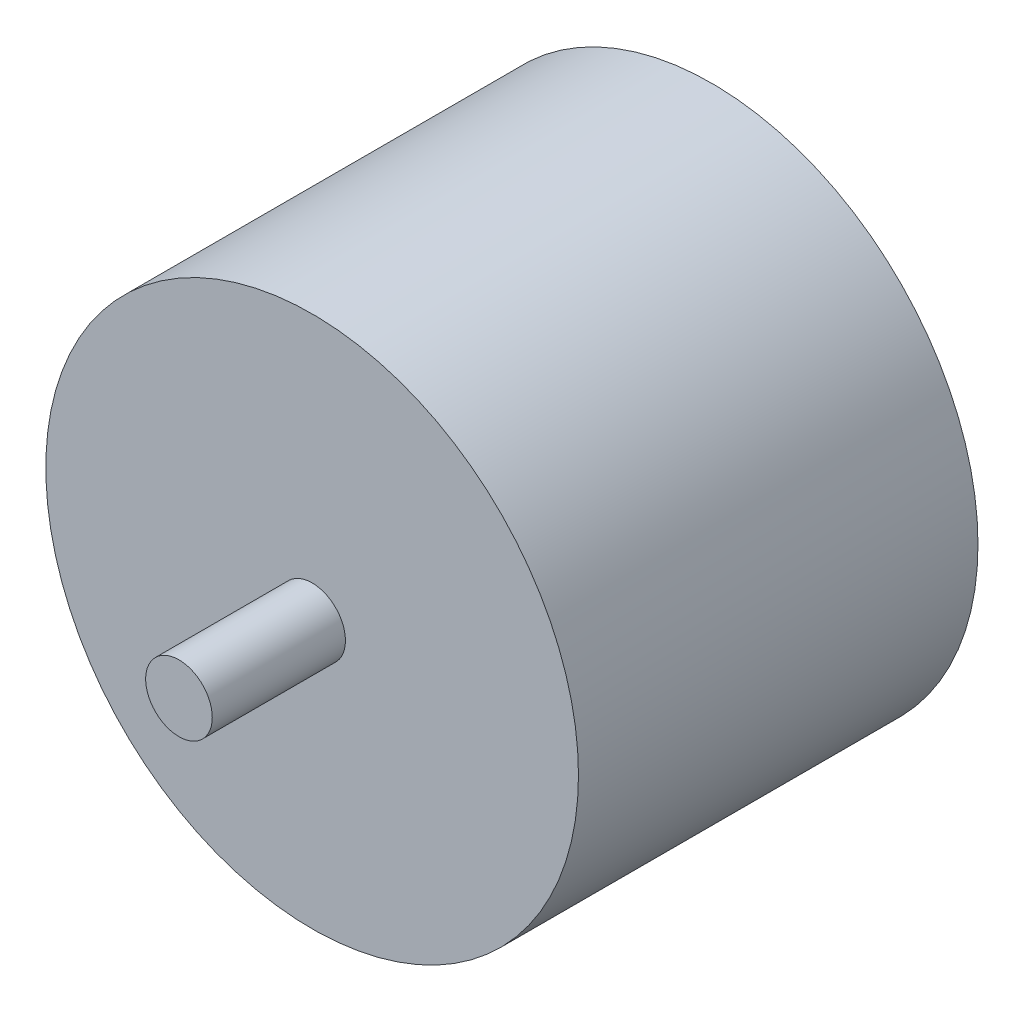
ISO-10303-21;
HEADER;
FILE_DESCRIPTION(('STEP AP214'),'2;1');
FILE_NAME('part.step','',(''),(''),'','','');
FILE_SCHEMA(('AUTOMOTIVE_DESIGN { 1 0 10303 214 1 1 1 1 }'));
ENDSEC;
DATA;
#1=APPLICATION_CONTEXT('core data for automotive mechanical design processes');
#2=APPLICATION_PROTOCOL_DEFINITION('international standard','automotive_design',2000,#1);
#3=PRODUCT_CONTEXT('',#1,'mechanical');
#4=PRODUCT('Part','Part','',(#3));
#5=PRODUCT_RELATED_PRODUCT_CATEGORY('part','',(#4));
#6=PRODUCT_DEFINITION_FORMATION('','',#4);
#7=PRODUCT_DEFINITION_CONTEXT('part definition',#1,'design');
#8=PRODUCT_DEFINITION('design','',#6,#7);
#9=PRODUCT_DEFINITION_SHAPE('','',#8);
#10=(LENGTH_UNIT() NAMED_UNIT(*) SI_UNIT(.MILLI.,.METRE.));
#11=(NAMED_UNIT(*) PLANE_ANGLE_UNIT() SI_UNIT($,.RADIAN.));
#12=(NAMED_UNIT(*) SI_UNIT($,.STERADIAN.) SOLID_ANGLE_UNIT());
#13=UNCERTAINTY_MEASURE_WITH_UNIT(LENGTH_MEASURE(1.E-05),#10,'distance_accuracy_value','');
#14=(GEOMETRIC_REPRESENTATION_CONTEXT(3) GLOBAL_UNCERTAINTY_ASSIGNED_CONTEXT((#13)) GLOBAL_UNIT_ASSIGNED_CONTEXT((#10,
#11,#12)) REPRESENTATION_CONTEXT('',''));
#15=CARTESIAN_POINT('',(0.,0.,0.));
#16=DIRECTION('',(0.,0.,1.));
#17=DIRECTION('',(1.,0.,0.));
#18=AXIS2_PLACEMENT_3D('',#15,#16,#17);
#19=CARTESIAN_POINT('',(0.,0.,19.05));
#20=DIRECTION('',(0.,0.,1.));
#21=DIRECTION('',(1.,0.,0.));
#22=AXIS2_PLACEMENT_3D('',#19,#20,#21);
#23=PLANE('',#22);
#24=CARTESIAN_POINT('',(0.,0.,19.05));
#25=DIRECTION('',(0.,0.,1.));
#26=DIRECTION('',(1.,0.,0.));
#27=AXIS2_PLACEMENT_3D('',#24,#25,#26);
#28=CIRCLE('',#27,25.4);
#29=CARTESIAN_POINT('',(25.4,0.,19.05));
#30=VERTEX_POINT('',#29);
#31=EDGE_CURVE('E10',#30,#30,#28,.T.);
#32=ORIENTED_EDGE('',*,*,#31,.T.);
#33=EDGE_LOOP('',(#32));
#34=FACE_BOUND('',#33,.T.);
#35=CARTESIAN_POINT('',(0.,0.,19.05));
#36=DIRECTION('',(0.,0.,1.));
#37=DIRECTION('',(1.,0.,0.));
#38=AXIS2_PLACEMENT_3D('',#35,#36,#37);
#39=CIRCLE('',#38,3.175);
#40=CARTESIAN_POINT('',(3.175,0.,19.05));
#41=VERTEX_POINT('',#40);
#42=EDGE_CURVE('E44',#41,#41,#39,.T.);
#43=ORIENTED_EDGE('',*,*,#42,.F.);
#44=EDGE_LOOP('',(#43));
#45=FACE_BOUND('',#44,.T.);
#46=ADVANCED_FACE('F31',(#34,#45),#23,.T.);
#47=CARTESIAN_POINT('',(0.,0.,19.05));
#48=DIRECTION('',(0.,0.,-1.));
#49=DIRECTION('',(-1.,0.,0.));
#50=AXIS2_PLACEMENT_3D('',#47,#48,#49);
#51=CYLINDRICAL_SURFACE('',#50,25.4);
#52=ORIENTED_EDGE('',*,*,#31,.F.);
#53=EDGE_LOOP('',(#52));
#54=FACE_BOUND('',#53,.T.);
#55=CARTESIAN_POINT('',(0.,0.,-19.05));
#56=DIRECTION('',(0.,0.,1.));
#57=DIRECTION('',(1.,0.,0.));
#58=AXIS2_PLACEMENT_3D('',#55,#56,#57);
#59=CIRCLE('',#58,25.4);
#60=CARTESIAN_POINT('',(25.4,0.,-19.05));
#61=VERTEX_POINT('',#60);
#62=EDGE_CURVE('E35',#61,#61,#59,.T.);
#63=ORIENTED_EDGE('',*,*,#62,.T.);
#64=EDGE_LOOP('',(#63));
#65=FACE_BOUND('',#64,.T.);
#66=ADVANCED_FACE('F33',(#54,#65),#51,.T.);
#67=CARTESIAN_POINT('',(0.,0.,-19.05));
#68=DIRECTION('',(0.,0.,1.));
#69=DIRECTION('',(1.,0.,0.));
#70=AXIS2_PLACEMENT_3D('',#67,#68,#69);
#71=PLANE('',#70);
#72=CARTESIAN_POINT('',(0.,0.,-19.05));
#73=DIRECTION('',(0.,0.,1.));
#74=DIRECTION('',(1.,0.,0.));
#75=AXIS2_PLACEMENT_3D('',#72,#73,#74);
#76=CIRCLE('',#75,3.175);
#77=CARTESIAN_POINT('',(3.175,0.,-19.05));
#78=VERTEX_POINT('',#77);
#79=EDGE_CURVE('E50',#78,#78,#76,.T.);
#80=ORIENTED_EDGE('',*,*,#79,.T.);
#81=EDGE_LOOP('',(#80));
#82=FACE_BOUND('',#81,.T.);
#83=ORIENTED_EDGE('',*,*,#62,.F.);
#84=EDGE_LOOP('',(#83));
#85=FACE_BOUND('',#84,.T.);
#86=ADVANCED_FACE('F72',(#82,#85),#71,.F.);
#87=CARTESIAN_POINT('',(0.,0.,31.75));
#88=DIRECTION('',(0.,0.,-1.));
#89=DIRECTION('',(-1.,0.,0.));
#90=AXIS2_PLACEMENT_3D('',#87,#88,#89);
#91=CYLINDRICAL_SURFACE('',#90,3.175);
#92=CARTESIAN_POINT('',(0.,0.,31.75));
#93=DIRECTION('',(0.,0.,1.));
#94=DIRECTION('',(1.,0.,0.));
#95=AXIS2_PLACEMENT_3D('',#92,#93,#94);
#96=CIRCLE('',#95,3.175);
#97=CARTESIAN_POINT('',(3.175,0.,31.75));
#98=VERTEX_POINT('',#97);
#99=EDGE_CURVE('E42',#98,#98,#96,.T.);
#100=ORIENTED_EDGE('',*,*,#99,.F.);
#101=EDGE_LOOP('',(#100));
#102=FACE_BOUND('',#101,.T.);
#103=ORIENTED_EDGE('',*,*,#42,.T.);
#104=EDGE_LOOP('',(#103));
#105=FACE_BOUND('',#104,.T.);
#106=ADVANCED_FACE('F76',(#102,#105),#91,.T.);
#107=CARTESIAN_POINT('',(0.,0.,31.75));
#108=DIRECTION('',(0.,0.,1.));
#109=DIRECTION('',(1.,0.,0.));
#110=AXIS2_PLACEMENT_3D('',#107,#108,#109);
#111=PLANE('',#110);
#112=ORIENTED_EDGE('',*,*,#99,.T.);
#113=EDGE_LOOP('',(#112));
#114=FACE_BOUND('',#113,.T.);
#115=ADVANCED_FACE('F65',(#114),#111,.T.);
#116=CARTESIAN_POINT('',(0.,0.,-31.75));
#117=DIRECTION('',(0.,0.,1.));
#118=DIRECTION('',(1.,0.,0.));
#119=AXIS2_PLACEMENT_3D('',#116,#117,#118);
#120=CYLINDRICAL_SURFACE('',#119,3.175);
#121=CARTESIAN_POINT('',(0.,0.,-31.75));
#122=DIRECTION('',(0.,0.,1.));
#123=DIRECTION('',(1.,0.,0.));
#124=AXIS2_PLACEMENT_3D('',#121,#122,#123);
#125=CIRCLE('',#124,3.175);
#126=CARTESIAN_POINT('',(3.175,0.,-31.75));
#127=VERTEX_POINT('',#126);
#128=EDGE_CURVE('E47',#127,#127,#125,.T.);
#129=ORIENTED_EDGE('',*,*,#128,.T.);
#130=EDGE_LOOP('',(#129));
#131=FACE_BOUND('',#130,.T.);
#132=ORIENTED_EDGE('',*,*,#79,.F.);
#133=EDGE_LOOP('',(#132));
#134=FACE_BOUND('',#133,.T.);
#135=ADVANCED_FACE('F56',(#131,#134),#120,.T.);
#136=CARTESIAN_POINT('',(0.,0.,-31.75));
#137=DIRECTION('',(0.,0.,-1.));
#138=DIRECTION('',(1.,0.,0.));
#139=AXIS2_PLACEMENT_3D('',#136,#137,#138);
#140=PLANE('',#139);
#141=ORIENTED_EDGE('',*,*,#128,.F.);
#142=EDGE_LOOP('',(#141));
#143=FACE_BOUND('',#142,.T.);
#144=ADVANCED_FACE('F59',(#143),#140,.T.);
#145=CLOSED_SHELL('',(#46,#66,#86,#106,#115,#135,#144));
#146=MANIFOLD_SOLID_BREP('B2',#145);
#147=ADVANCED_BREP_SHAPE_REPRESENTATION('',(#18,#146),#14);
#148=SHAPE_DEFINITION_REPRESENTATION(#9,#147);
ENDSEC;
END-ISO-10303-21;
